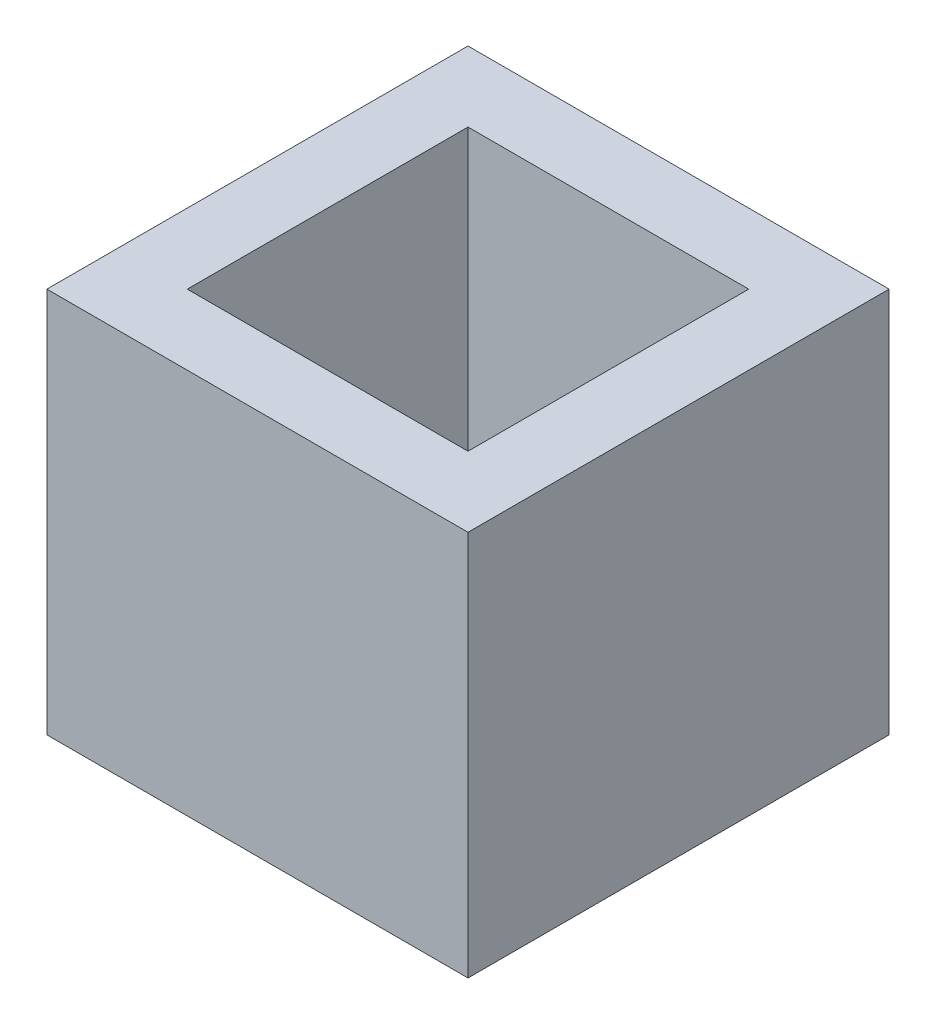
ISO-10303-21;
HEADER;
FILE_DESCRIPTION(('STEP AP214'),'2;1');
FILE_NAME('part.step','',(''),(''),'','','');
FILE_SCHEMA(('AUTOMOTIVE_DESIGN { 1 0 10303 214 1 1 1 1 }'));
ENDSEC;
DATA;
#1=APPLICATION_CONTEXT('core data for automotive mechanical design processes');
#2=APPLICATION_PROTOCOL_DEFINITION('international standard','automotive_design',2000,#1);
#3=PRODUCT_CONTEXT('',#1,'mechanical');
#4=PRODUCT('Part','Part','',(#3));
#5=PRODUCT_RELATED_PRODUCT_CATEGORY('part','',(#4));
#6=PRODUCT_DEFINITION_FORMATION('','',#4);
#7=PRODUCT_DEFINITION_CONTEXT('part definition',#1,'design');
#8=PRODUCT_DEFINITION('design','',#6,#7);
#9=PRODUCT_DEFINITION_SHAPE('','',#8);
#10=(LENGTH_UNIT() NAMED_UNIT(*) SI_UNIT(.MILLI.,.METRE.));
#11=(NAMED_UNIT(*) PLANE_ANGLE_UNIT() SI_UNIT($,.RADIAN.));
#12=(NAMED_UNIT(*) SI_UNIT($,.STERADIAN.) SOLID_ANGLE_UNIT());
#13=UNCERTAINTY_MEASURE_WITH_UNIT(LENGTH_MEASURE(1.E-05),#10,'distance_accuracy_value','');
#14=(GEOMETRIC_REPRESENTATION_CONTEXT(3) GLOBAL_UNCERTAINTY_ASSIGNED_CONTEXT((#13)) GLOBAL_UNIT_ASSIGNED_CONTEXT((#10,
#11,#12)) REPRESENTATION_CONTEXT('',''));
#15=CARTESIAN_POINT('',(0.,0.,0.));
#16=DIRECTION('',(0.,0.,1.));
#17=DIRECTION('',(1.,0.,0.));
#18=AXIS2_PLACEMENT_3D('',#15,#16,#17);
#19=CARTESIAN_POINT('',(0.,11.,0.));
#20=DIRECTION('',(0.,-1.,0.));
#21=DIRECTION('',(0.,0.,-1.));
#22=AXIS2_PLACEMENT_3D('',#19,#20,#21);
#23=PLANE('',#22);
#24=DIRECTION('',(0.,0.,1.));
#25=VECTOR('',#24,1.);
#26=CARTESIAN_POINT('',(0.,11.,0.));
#27=LINE('',#26,#25);
#28=CARTESIAN_POINT('',(0.,11.,-12.));
#29=VERTEX_POINT('',#28);
#30=CARTESIAN_POINT('',(0.,11.,0.));
#31=VERTEX_POINT('',#30);
#32=EDGE_CURVE('E162',#29,#31,#27,.T.);
#33=ORIENTED_EDGE('',*,*,#32,.T.);
#34=DIRECTION('',(1.,0.,0.));
#35=VECTOR('',#34,1.);
#36=CARTESIAN_POINT('',(0.,11.,0.));
#37=LINE('',#36,#35);
#38=CARTESIAN_POINT('',(12.,11.,0.));
#39=VERTEX_POINT('',#38);
#40=EDGE_CURVE('E97',#31,#39,#37,.T.);
#41=ORIENTED_EDGE('',*,*,#40,.T.);
#42=DIRECTION('',(0.,0.,-1.));
#43=VECTOR('',#42,1.);
#44=CARTESIAN_POINT('',(12.,11.,0.));
#45=LINE('',#44,#43);
#46=CARTESIAN_POINT('',(12.,11.,-12.));
#47=VERTEX_POINT('',#46);
#48=EDGE_CURVE('E167',#39,#47,#45,.T.);
#49=ORIENTED_EDGE('',*,*,#48,.T.);
#50=DIRECTION('',(-1.,0.,0.));
#51=VECTOR('',#50,1.);
#52=CARTESIAN_POINT('',(0.,11.,-12.));
#53=LINE('',#52,#51);
#54=EDGE_CURVE('E69',#47,#29,#53,.T.);
#55=ORIENTED_EDGE('',*,*,#54,.T.);
#56=EDGE_LOOP('',(#33,#41,#49,#55));
#57=FACE_BOUND('',#56,.T.);
#58=DIRECTION('',(0.,0.,1.));
#59=VECTOR('',#58,1.);
#60=CARTESIAN_POINT('',(2.,11.,0.));
#61=LINE('',#60,#59);
#62=CARTESIAN_POINT('',(2.,11.,-10.));
#63=VERTEX_POINT('',#62);
#64=CARTESIAN_POINT('',(2.,11.,-2.));
#65=VERTEX_POINT('',#64);
#66=EDGE_CURVE('E146',#63,#65,#61,.T.);
#67=ORIENTED_EDGE('',*,*,#66,.F.);
#68=DIRECTION('',(-1.,0.,0.));
#69=VECTOR('',#68,1.);
#70=CARTESIAN_POINT('',(0.,11.,-10.));
#71=LINE('',#70,#69);
#72=CARTESIAN_POINT('',(10.,11.,-10.));
#73=VERTEX_POINT('',#72);
#74=EDGE_CURVE('E159',#73,#63,#71,.T.);
#75=ORIENTED_EDGE('',*,*,#74,.F.);
#76=DIRECTION('',(0.,0.,-1.));
#77=VECTOR('',#76,1.);
#78=CARTESIAN_POINT('',(10.,11.,0.));
#79=LINE('',#78,#77);
#80=CARTESIAN_POINT('',(10.,11.,-2.));
#81=VERTEX_POINT('',#80);
#82=EDGE_CURVE('E156',#81,#73,#79,.T.);
#83=ORIENTED_EDGE('',*,*,#82,.F.);
#84=DIRECTION('',(1.,0.,0.));
#85=VECTOR('',#84,1.);
#86=CARTESIAN_POINT('',(0.,11.,-2.));
#87=LINE('',#86,#85);
#88=EDGE_CURVE('E135',#65,#81,#87,.T.);
#89=ORIENTED_EDGE('',*,*,#88,.F.);
#90=EDGE_LOOP('',(#67,#75,#83,#89));
#91=FACE_BOUND('',#90,.T.);
#92=ADVANCED_FACE('F42',(#57,#91),#23,.F.);
#93=CARTESIAN_POINT('',(0.,11.,0.));
#94=DIRECTION('',(1.,0.,0.));
#95=DIRECTION('',(0.,0.,-1.));
#96=AXIS2_PLACEMENT_3D('',#93,#94,#95);
#97=PLANE('',#96);
#98=DIRECTION('',(0.,0.,1.));
#99=VECTOR('',#98,1.);
#100=CARTESIAN_POINT('',(0.,0.,0.));
#101=LINE('',#100,#99);
#102=CARTESIAN_POINT('',(0.,0.,-12.));
#103=VERTEX_POINT('',#102);
#104=CARTESIAN_POINT('',(0.,0.,0.));
#105=VERTEX_POINT('',#104);
#106=EDGE_CURVE('E173',#103,#105,#101,.T.);
#107=ORIENTED_EDGE('',*,*,#106,.T.);
#108=DIRECTION('',(0.,-1.,0.));
#109=VECTOR('',#108,1.);
#110=CARTESIAN_POINT('',(0.,11.,0.));
#111=LINE('',#110,#109);
#112=EDGE_CURVE('E11',#31,#105,#111,.T.);
#113=ORIENTED_EDGE('',*,*,#112,.F.);
#114=ORIENTED_EDGE('',*,*,#32,.F.);
#115=DIRECTION('',(0.,-1.,0.));
#116=VECTOR('',#115,1.);
#117=CARTESIAN_POINT('',(0.,11.,-12.));
#118=LINE('',#117,#116);
#119=EDGE_CURVE('E172',#29,#103,#118,.T.);
#120=ORIENTED_EDGE('',*,*,#119,.T.);
#121=EDGE_LOOP('',(#107,#113,#114,#120));
#122=FACE_BOUND('',#121,.T.);
#123=ADVANCED_FACE('F44',(#122),#97,.F.);
#124=CARTESIAN_POINT('',(0.,11.,0.));
#125=DIRECTION('',(0.,0.,-1.));
#126=DIRECTION('',(-1.,0.,0.));
#127=AXIS2_PLACEMENT_3D('',#124,#125,#126);
#128=PLANE('',#127);
#129=DIRECTION('',(1.,0.,0.));
#130=VECTOR('',#129,1.);
#131=CARTESIAN_POINT('',(0.,0.,0.));
#132=LINE('',#131,#130);
#133=CARTESIAN_POINT('',(12.,0.,0.));
#134=VERTEX_POINT('',#133);
#135=EDGE_CURVE('E177',#105,#134,#132,.T.);
#136=ORIENTED_EDGE('',*,*,#135,.T.);
#137=DIRECTION('',(0.,-1.,0.));
#138=VECTOR('',#137,1.);
#139=CARTESIAN_POINT('',(12.,11.,0.));
#140=LINE('',#139,#138);
#141=EDGE_CURVE('E52',#39,#134,#140,.T.);
#142=ORIENTED_EDGE('',*,*,#141,.F.);
#143=ORIENTED_EDGE('',*,*,#40,.F.);
#144=ORIENTED_EDGE('',*,*,#112,.T.);
#145=EDGE_LOOP('',(#136,#142,#143,#144));
#146=FACE_BOUND('',#145,.T.);
#147=ADVANCED_FACE('F228',(#146),#128,.F.);
#148=CARTESIAN_POINT('',(12.,11.,0.));
#149=DIRECTION('',(-1.,0.,0.));
#150=DIRECTION('',(0.,0.,1.));
#151=AXIS2_PLACEMENT_3D('',#148,#149,#150);
#152=PLANE('',#151);
#153=DIRECTION('',(0.,0.,-1.));
#154=VECTOR('',#153,1.);
#155=CARTESIAN_POINT('',(12.,0.,0.));
#156=LINE('',#155,#154);
#157=CARTESIAN_POINT('',(12.,0.,-12.));
#158=VERTEX_POINT('',#157);
#159=EDGE_CURVE('E180',#134,#158,#156,.T.);
#160=ORIENTED_EDGE('',*,*,#159,.T.);
#161=DIRECTION('',(0.,-1.,0.));
#162=VECTOR('',#161,1.);
#163=CARTESIAN_POINT('',(12.,11.,-12.));
#164=LINE('',#163,#162);
#165=EDGE_CURVE('E187',#47,#158,#164,.T.);
#166=ORIENTED_EDGE('',*,*,#165,.F.);
#167=ORIENTED_EDGE('',*,*,#48,.F.);
#168=ORIENTED_EDGE('',*,*,#141,.T.);
#169=EDGE_LOOP('',(#160,#166,#167,#168));
#170=FACE_BOUND('',#169,.T.);
#171=ADVANCED_FACE('F240',(#170),#152,.F.);
#172=CARTESIAN_POINT('',(0.,11.,-12.));
#173=DIRECTION('',(0.,0.,1.));
#174=DIRECTION('',(1.,0.,0.));
#175=AXIS2_PLACEMENT_3D('',#172,#173,#174);
#176=PLANE('',#175);
#177=DIRECTION('',(-1.,0.,0.));
#178=VECTOR('',#177,1.);
#179=CARTESIAN_POINT('',(0.,0.,-12.));
#180=LINE('',#179,#178);
#181=EDGE_CURVE('E90',#158,#103,#180,.T.);
#182=ORIENTED_EDGE('',*,*,#181,.T.);
#183=ORIENTED_EDGE('',*,*,#119,.F.);
#184=ORIENTED_EDGE('',*,*,#54,.F.);
#185=ORIENTED_EDGE('',*,*,#165,.T.);
#186=EDGE_LOOP('',(#182,#183,#184,#185));
#187=FACE_BOUND('',#186,.T.);
#188=ADVANCED_FACE('F236',(#187),#176,.F.);
#189=CARTESIAN_POINT('',(0.,0.,0.));
#190=DIRECTION('',(0.,-1.,0.));
#191=DIRECTION('',(0.,0.,-1.));
#192=AXIS2_PLACEMENT_3D('',#189,#190,#191);
#193=PLANE('',#192);
#194=CARTESIAN_POINT('',(6.,0.,-4.73));
#195=DIRECTION('',(0.,-1.,0.));
#196=DIRECTION('',(0.,0.,-1.));
#197=AXIS2_PLACEMENT_3D('',#194,#195,#196);
#198=CIRCLE('',#197,0.625);
#199=CARTESIAN_POINT('',(6.,0.,-5.355));
#200=VERTEX_POINT('',#199);
#201=EDGE_CURVE('E195',#200,#200,#198,.T.);
#202=ORIENTED_EDGE('',*,*,#201,.F.);
#203=EDGE_LOOP('',(#202));
#204=FACE_BOUND('',#203,.T.);
#205=CARTESIAN_POINT('',(6.,0.,-7.27));
#206=DIRECTION('',(0.,-1.,0.));
#207=DIRECTION('',(0.,0.,-1.));
#208=AXIS2_PLACEMENT_3D('',#205,#206,#207);
#209=CIRCLE('',#208,0.625);
#210=CARTESIAN_POINT('',(6.,0.,-7.895));
#211=VERTEX_POINT('',#210);
#212=EDGE_CURVE('E202',#211,#211,#209,.T.);
#213=ORIENTED_EDGE('',*,*,#212,.F.);
#214=EDGE_LOOP('',(#213));
#215=FACE_BOUND('',#214,.T.);
#216=ORIENTED_EDGE('',*,*,#106,.F.);
#217=ORIENTED_EDGE('',*,*,#181,.F.);
#218=ORIENTED_EDGE('',*,*,#159,.F.);
#219=ORIENTED_EDGE('',*,*,#135,.F.);
#220=EDGE_LOOP('',(#216,#217,#218,#219));
#221=FACE_BOUND('',#220,.T.);
#222=ADVANCED_FACE('F233',(#204,#215,#221),#193,.T.);
#223=CARTESIAN_POINT('',(2.,11.,0.));
#224=DIRECTION('',(1.,0.,0.));
#225=DIRECTION('',(0.,0.,-1.));
#226=AXIS2_PLACEMENT_3D('',#223,#224,#225);
#227=PLANE('',#226);
#228=DIRECTION('',(0.,0.,1.));
#229=VECTOR('',#228,1.);
#230=CARTESIAN_POINT('',(2.,2.,0.));
#231=LINE('',#230,#229);
#232=CARTESIAN_POINT('',(2.,2.,-10.));
#233=VERTEX_POINT('',#232);
#234=CARTESIAN_POINT('',(2.,2.,-2.));
#235=VERTEX_POINT('',#234);
#236=EDGE_CURVE('E125',#233,#235,#231,.T.);
#237=ORIENTED_EDGE('',*,*,#236,.F.);
#238=DIRECTION('',(0.,-1.,0.));
#239=VECTOR('',#238,1.);
#240=CARTESIAN_POINT('',(2.,11.,-10.));
#241=LINE('',#240,#239);
#242=EDGE_CURVE('E150',#63,#233,#241,.T.);
#243=ORIENTED_EDGE('',*,*,#242,.F.);
#244=ORIENTED_EDGE('',*,*,#66,.T.);
#245=DIRECTION('',(0.,-1.,0.));
#246=VECTOR('',#245,1.);
#247=CARTESIAN_POINT('',(2.,11.,-2.));
#248=LINE('',#247,#246);
#249=EDGE_CURVE('E139',#65,#235,#248,.T.);
#250=ORIENTED_EDGE('',*,*,#249,.T.);
#251=EDGE_LOOP('',(#237,#243,#244,#250));
#252=FACE_BOUND('',#251,.T.);
#253=ADVANCED_FACE('F221',(#252),#227,.T.);
#254=CARTESIAN_POINT('',(0.,11.,-2.));
#255=DIRECTION('',(0.,0.,-1.));
#256=DIRECTION('',(-1.,0.,0.));
#257=AXIS2_PLACEMENT_3D('',#254,#255,#256);
#258=PLANE('',#257);
#259=DIRECTION('',(1.,0.,0.));
#260=VECTOR('',#259,1.);
#261=CARTESIAN_POINT('',(0.,2.,-2.));
#262=LINE('',#261,#260);
#263=CARTESIAN_POINT('',(10.,2.,-2.));
#264=VERTEX_POINT('',#263);
#265=EDGE_CURVE('E119',#235,#264,#262,.T.);
#266=ORIENTED_EDGE('',*,*,#265,.F.);
#267=ORIENTED_EDGE('',*,*,#249,.F.);
#268=ORIENTED_EDGE('',*,*,#88,.T.);
#269=DIRECTION('',(0.,-1.,0.));
#270=VECTOR('',#269,1.);
#271=CARTESIAN_POINT('',(10.,11.,-2.));
#272=LINE('',#271,#270);
#273=EDGE_CURVE('E132',#81,#264,#272,.T.);
#274=ORIENTED_EDGE('',*,*,#273,.T.);
#275=EDGE_LOOP('',(#266,#267,#268,#274));
#276=FACE_BOUND('',#275,.T.);
#277=ADVANCED_FACE('F133',(#276),#258,.T.);
#278=CARTESIAN_POINT('',(10.,11.,0.));
#279=DIRECTION('',(-1.,0.,0.));
#280=DIRECTION('',(0.,0.,1.));
#281=AXIS2_PLACEMENT_3D('',#278,#279,#280);
#282=PLANE('',#281);
#283=DIRECTION('',(0.,0.,-1.));
#284=VECTOR('',#283,1.);
#285=CARTESIAN_POINT('',(10.,2.,0.));
#286=LINE('',#285,#284);
#287=CARTESIAN_POINT('',(10.,2.,-10.));
#288=VERTEX_POINT('',#287);
#289=EDGE_CURVE('E123',#264,#288,#286,.T.);
#290=ORIENTED_EDGE('',*,*,#289,.F.);
#291=ORIENTED_EDGE('',*,*,#273,.F.);
#292=ORIENTED_EDGE('',*,*,#82,.T.);
#293=DIRECTION('',(0.,-1.,0.));
#294=VECTOR('',#293,1.);
#295=CARTESIAN_POINT('',(10.,11.,-10.));
#296=LINE('',#295,#294);
#297=EDGE_CURVE('E60',#73,#288,#296,.T.);
#298=ORIENTED_EDGE('',*,*,#297,.T.);
#299=EDGE_LOOP('',(#290,#291,#292,#298));
#300=FACE_BOUND('',#299,.T.);
#301=ADVANCED_FACE('F141',(#300),#282,.T.);
#302=CARTESIAN_POINT('',(0.,11.,-10.));
#303=DIRECTION('',(0.,0.,1.));
#304=DIRECTION('',(1.,0.,0.));
#305=AXIS2_PLACEMENT_3D('',#302,#303,#304);
#306=PLANE('',#305);
#307=DIRECTION('',(-1.,0.,0.));
#308=VECTOR('',#307,1.);
#309=CARTESIAN_POINT('',(0.,2.,-10.));
#310=LINE('',#309,#308);
#311=EDGE_CURVE('E143',#288,#233,#310,.T.);
#312=ORIENTED_EDGE('',*,*,#311,.F.);
#313=ORIENTED_EDGE('',*,*,#297,.F.);
#314=ORIENTED_EDGE('',*,*,#74,.T.);
#315=ORIENTED_EDGE('',*,*,#242,.T.);
#316=EDGE_LOOP('',(#312,#313,#314,#315));
#317=FACE_BOUND('',#316,.T.);
#318=ADVANCED_FACE('F217',(#317),#306,.T.);
#319=CARTESIAN_POINT('',(0.,2.,0.));
#320=DIRECTION('',(0.,-1.,0.));
#321=DIRECTION('',(0.,0.,-1.));
#322=AXIS2_PLACEMENT_3D('',#319,#320,#321);
#323=PLANE('',#322);
#324=CARTESIAN_POINT('',(6.,2.,-4.73));
#325=DIRECTION('',(0.,-1.,0.));
#326=DIRECTION('',(0.,0.,-1.));
#327=AXIS2_PLACEMENT_3D('',#324,#325,#326);
#328=CIRCLE('',#327,0.625);
#329=CARTESIAN_POINT('',(6.,2.,-5.355));
#330=VERTEX_POINT('',#329);
#331=EDGE_CURVE('E46',#330,#330,#328,.T.);
#332=ORIENTED_EDGE('',*,*,#331,.T.);
#333=EDGE_LOOP('',(#332));
#334=FACE_BOUND('',#333,.T.);
#335=CARTESIAN_POINT('',(6.,2.,-7.27));
#336=DIRECTION('',(0.,-1.,0.));
#337=DIRECTION('',(0.,0.,-1.));
#338=AXIS2_PLACEMENT_3D('',#335,#336,#337);
#339=CIRCLE('',#338,0.625);
#340=CARTESIAN_POINT('',(6.,2.,-7.895));
#341=VERTEX_POINT('',#340);
#342=EDGE_CURVE('E192',#341,#341,#339,.T.);
#343=ORIENTED_EDGE('',*,*,#342,.T.);
#344=EDGE_LOOP('',(#343));
#345=FACE_BOUND('',#344,.T.);
#346=ORIENTED_EDGE('',*,*,#236,.T.);
#347=ORIENTED_EDGE('',*,*,#265,.T.);
#348=ORIENTED_EDGE('',*,*,#289,.T.);
#349=ORIENTED_EDGE('',*,*,#311,.T.);
#350=EDGE_LOOP('',(#346,#347,#348,#349));
#351=FACE_BOUND('',#350,.T.);
#352=ADVANCED_FACE('F121',(#334,#345,#351),#323,.F.);
#353=CARTESIAN_POINT('',(6.,10.,-7.27));
#354=DIRECTION('',(0.,-1.,0.));
#355=DIRECTION('',(0.,0.,-1.));
#356=AXIS2_PLACEMENT_3D('',#353,#354,#355);
#357=CYLINDRICAL_SURFACE('',#356,0.625);
#358=ORIENTED_EDGE('',*,*,#212,.T.);
#359=EDGE_LOOP('',(#358));
#360=FACE_BOUND('',#359,.T.);
#361=ORIENTED_EDGE('',*,*,#342,.F.);
#362=EDGE_LOOP('',(#361));
#363=FACE_BOUND('',#362,.T.);
#364=ADVANCED_FACE('F301',(#360,#363),#357,.F.);
#365=CARTESIAN_POINT('',(6.,10.,-4.73));
#366=DIRECTION('',(0.,-1.,0.));
#367=DIRECTION('',(0.,0.,-1.));
#368=AXIS2_PLACEMENT_3D('',#365,#366,#367);
#369=CYLINDRICAL_SURFACE('',#368,0.625);
#370=ORIENTED_EDGE('',*,*,#201,.T.);
#371=EDGE_LOOP('',(#370));
#372=FACE_BOUND('',#371,.T.);
#373=ORIENTED_EDGE('',*,*,#331,.F.);
#374=EDGE_LOOP('',(#373));
#375=FACE_BOUND('',#374,.T.);
#376=ADVANCED_FACE('F311',(#372,#375),#369,.F.);
#377=CLOSED_SHELL('',(#92,#123,#147,#171,#188,#222,#253,#277,#301,#318,#352,#364,#376));
#378=MANIFOLD_SOLID_BREP('B2',#377);
#379=ADVANCED_BREP_SHAPE_REPRESENTATION('',(#18,#378),#14);
#380=SHAPE_DEFINITION_REPRESENTATION(#9,#379);
ENDSEC;
END-ISO-10303-21;
